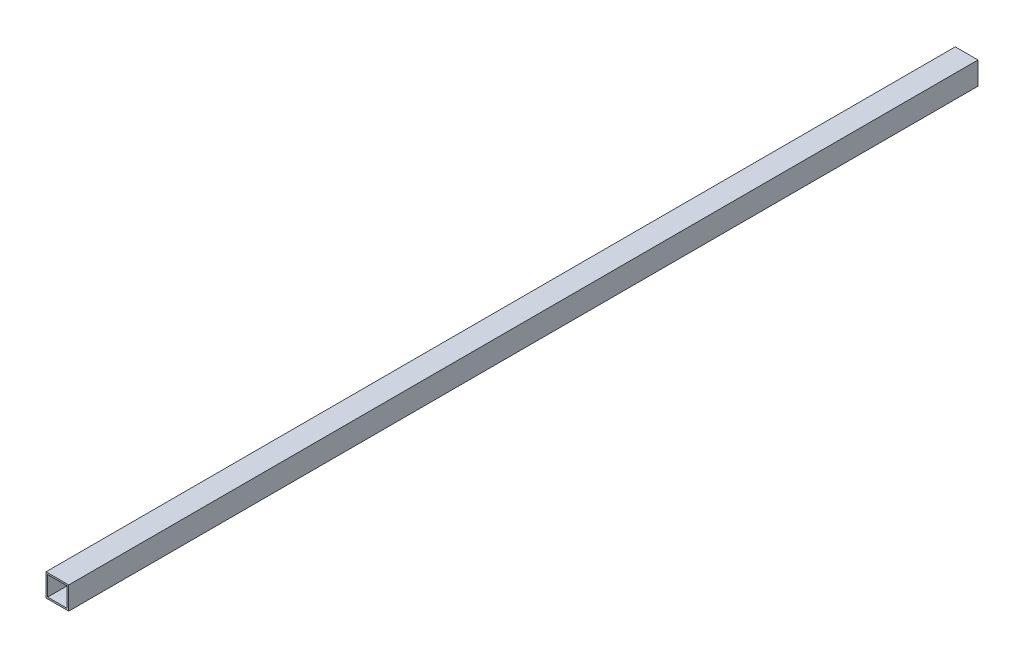
ISO-10303-21;
HEADER;
FILE_DESCRIPTION(('STEP AP214'),'2;1');
FILE_NAME('part.step','',(''),(''),'','','');
FILE_SCHEMA(('AUTOMOTIVE_DESIGN { 1 0 10303 214 1 1 1 1 }'));
ENDSEC;
DATA;
#1=APPLICATION_CONTEXT('core data for automotive mechanical design processes');
#2=APPLICATION_PROTOCOL_DEFINITION('international standard','automotive_design',2000,#1);
#3=PRODUCT_CONTEXT('',#1,'mechanical');
#4=PRODUCT('Part','Part','',(#3));
#5=PRODUCT_RELATED_PRODUCT_CATEGORY('part','',(#4));
#6=PRODUCT_DEFINITION_FORMATION('','',#4);
#7=PRODUCT_DEFINITION_CONTEXT('part definition',#1,'design');
#8=PRODUCT_DEFINITION('design','',#6,#7);
#9=PRODUCT_DEFINITION_SHAPE('','',#8);
#10=(LENGTH_UNIT() NAMED_UNIT(*) SI_UNIT(.MILLI.,.METRE.));
#11=(NAMED_UNIT(*) PLANE_ANGLE_UNIT() SI_UNIT($,.RADIAN.));
#12=(NAMED_UNIT(*) SI_UNIT($,.STERADIAN.) SOLID_ANGLE_UNIT());
#13=UNCERTAINTY_MEASURE_WITH_UNIT(LENGTH_MEASURE(1.E-05),#10,'distance_accuracy_value','');
#14=(GEOMETRIC_REPRESENTATION_CONTEXT(3) GLOBAL_UNCERTAINTY_ASSIGNED_CONTEXT((#13)) GLOBAL_UNIT_ASSIGNED_CONTEXT((#10,
#11,#12)) REPRESENTATION_CONTEXT('',''));
#15=CARTESIAN_POINT('',(0.,0.,0.));
#16=DIRECTION('',(0.,0.,1.));
#17=DIRECTION('',(1.,0.,0.));
#18=AXIS2_PLACEMENT_3D('',#15,#16,#17);
#19=CARTESIAN_POINT('',(-21.5935896339443,-24.317947895419,0.));
#20=DIRECTION('',(-1.,0.,0.));
#21=DIRECTION('',(0.,0.,1.));
#22=AXIS2_PLACEMENT_3D('',#19,#20,#21);
#23=PLANE('',#22);
#24=DIRECTION('',(0.,1.,0.));
#25=VECTOR('',#24,1.);
#26=CARTESIAN_POINT('',(-21.5935896339443,-5.26794789541903,0.));
#27=LINE('',#26,#25);
#28=CARTESIAN_POINT('',(-21.5935896339443,-24.317947895419,0.));
#29=VERTEX_POINT('',#28);
#30=CARTESIAN_POINT('',(-21.5935896339443,13.782052104581,0.));
#31=VERTEX_POINT('',#30);
#32=EDGE_CURVE('E105',#29,#31,#27,.T.);
#33=ORIENTED_EDGE('',*,*,#32,.T.);
#34=DIRECTION('',(0.,0.,1.));
#35=VECTOR('',#34,1.);
#36=CARTESIAN_POINT('',(-21.5935896339443,13.782052104581,0.));
#37=LINE('',#36,#35);
#38=CARTESIAN_POINT('',(-21.5935896339443,13.782052104581,1778.));
#39=VERTEX_POINT('',#38);
#40=EDGE_CURVE('E20',#31,#39,#37,.T.);
#41=ORIENTED_EDGE('',*,*,#40,.T.);
#42=DIRECTION('',(0.,1.,0.));
#43=VECTOR('',#42,1.);
#44=CARTESIAN_POINT('',(-21.5935896339443,-5.26794789541903,1778.));
#45=LINE('',#44,#43);
#46=CARTESIAN_POINT('',(-21.5935896339443,-24.317947895419,1778.));
#47=VERTEX_POINT('',#46);
#48=EDGE_CURVE('E117',#47,#39,#45,.T.);
#49=ORIENTED_EDGE('',*,*,#48,.F.);
#50=DIRECTION('',(0.,0.,-1.));
#51=VECTOR('',#50,1.);
#52=CARTESIAN_POINT('',(-21.5935896339443,-24.317947895419,0.));
#53=LINE('',#52,#51);
#54=EDGE_CURVE('E101',#47,#29,#53,.T.);
#55=ORIENTED_EDGE('',*,*,#54,.T.);
#56=EDGE_LOOP('',(#33,#41,#49,#55));
#57=FACE_BOUND('',#56,.T.);
#58=ADVANCED_FACE('F17',(#57),#23,.F.);
#59=CARTESIAN_POINT('',(-21.5935896339443,13.782052104581,0.));
#60=DIRECTION('',(0.,1.,0.));
#61=DIRECTION('',(0.,0.,1.));
#62=AXIS2_PLACEMENT_3D('',#59,#60,#61);
#63=PLANE('',#62);
#64=DIRECTION('',(1.,0.,0.));
#65=VECTOR('',#64,1.);
#66=CARTESIAN_POINT('',(-2.54358963394426,13.782052104581,0.));
#67=LINE('',#66,#65);
#68=CARTESIAN_POINT('',(16.5064103660557,13.782052104581,0.));
#69=VERTEX_POINT('',#68);
#70=EDGE_CURVE('E107',#31,#69,#67,.T.);
#71=ORIENTED_EDGE('',*,*,#70,.T.);
#72=DIRECTION('',(0.,0.,-1.));
#73=VECTOR('',#72,1.);
#74=CARTESIAN_POINT('',(16.5064103660557,13.782052104581,0.));
#75=LINE('',#74,#73);
#76=CARTESIAN_POINT('',(16.5064103660557,13.782052104581,1778.));
#77=VERTEX_POINT('',#76);
#78=EDGE_CURVE('E79',#69,#77,#75,.F.);
#79=ORIENTED_EDGE('',*,*,#78,.T.);
#80=DIRECTION('',(1.,0.,0.));
#81=VECTOR('',#80,1.);
#82=CARTESIAN_POINT('',(-2.54358963394426,13.782052104581,1778.));
#83=LINE('',#82,#81);
#84=EDGE_CURVE('E119',#39,#77,#83,.T.);
#85=ORIENTED_EDGE('',*,*,#84,.F.);
#86=ORIENTED_EDGE('',*,*,#40,.F.);
#87=EDGE_LOOP('',(#71,#79,#85,#86));
#88=FACE_BOUND('',#87,.T.);
#89=ADVANCED_FACE('F120',(#88),#63,.F.);
#90=CARTESIAN_POINT('',(16.5064103660557,13.782052104581,0.));
#91=DIRECTION('',(1.,0.,0.));
#92=DIRECTION('',(0.,0.,-1.));
#93=AXIS2_PLACEMENT_3D('',#90,#91,#92);
#94=PLANE('',#93);
#95=DIRECTION('',(0.,1.,0.));
#96=VECTOR('',#95,1.);
#97=CARTESIAN_POINT('',(16.5064103660557,-5.26794789541903,0.));
#98=LINE('',#97,#96);
#99=CARTESIAN_POINT('',(16.5064103660557,-24.317947895419,0.));
#100=VERTEX_POINT('',#99);
#101=EDGE_CURVE('E82',#69,#100,#98,.F.);
#102=ORIENTED_EDGE('',*,*,#101,.T.);
#103=DIRECTION('',(0.,0.,-1.));
#104=VECTOR('',#103,1.);
#105=CARTESIAN_POINT('',(16.5064103660557,-24.317947895419,0.));
#106=LINE('',#105,#104);
#107=CARTESIAN_POINT('',(16.5064103660557,-24.317947895419,1778.));
#108=VERTEX_POINT('',#107);
#109=EDGE_CURVE('E85',#100,#108,#106,.F.);
#110=ORIENTED_EDGE('',*,*,#109,.T.);
#111=DIRECTION('',(0.,1.,0.));
#112=VECTOR('',#111,1.);
#113=CARTESIAN_POINT('',(16.5064103660557,-5.26794789541903,1778.));
#114=LINE('',#113,#112);
#115=EDGE_CURVE('E122',#77,#108,#114,.F.);
#116=ORIENTED_EDGE('',*,*,#115,.F.);
#117=ORIENTED_EDGE('',*,*,#78,.F.);
#118=EDGE_LOOP('',(#102,#110,#116,#117));
#119=FACE_BOUND('',#118,.T.);
#120=ADVANCED_FACE('F84',(#119),#94,.F.);
#121=CARTESIAN_POINT('',(16.5064103660557,-24.317947895419,0.));
#122=DIRECTION('',(0.,-1.,0.));
#123=DIRECTION('',(0.,0.,-1.));
#124=AXIS2_PLACEMENT_3D('',#121,#122,#123);
#125=PLANE('',#124);
#126=DIRECTION('',(1.,0.,0.));
#127=VECTOR('',#126,1.);
#128=CARTESIAN_POINT('',(-2.54358963394426,-24.317947895419,0.));
#129=LINE('',#128,#127);
#130=EDGE_CURVE('E90',#100,#29,#129,.F.);
#131=ORIENTED_EDGE('',*,*,#130,.T.);
#132=ORIENTED_EDGE('',*,*,#54,.F.);
#133=DIRECTION('',(1.,0.,0.));
#134=VECTOR('',#133,1.);
#135=CARTESIAN_POINT('',(-2.54358963394426,-24.317947895419,1778.));
#136=LINE('',#135,#134);
#137=EDGE_CURVE('E99',#108,#47,#136,.F.);
#138=ORIENTED_EDGE('',*,*,#137,.F.);
#139=ORIENTED_EDGE('',*,*,#109,.F.);
#140=EDGE_LOOP('',(#131,#132,#138,#139));
#141=FACE_BOUND('',#140,.T.);
#142=ADVANCED_FACE('F95',(#141),#125,.F.);
#143=CARTESIAN_POINT('',(19.6814103660557,-27.4929478954189,0.));
#144=DIRECTION('',(0.,-1.,0.));
#145=DIRECTION('',(0.,0.,-1.));
#146=AXIS2_PLACEMENT_3D('',#143,#144,#145);
#147=PLANE('',#146);
#148=DIRECTION('',(1.,0.,0.));
#149=VECTOR('',#148,1.);
#150=CARTESIAN_POINT('',(-2.54358963394426,-27.4929478954189,1778.));
#151=LINE('',#150,#149);
#152=CARTESIAN_POINT('',(-24.7685896339443,-27.4929478954189,1778.));
#153=VERTEX_POINT('',#152);
#154=CARTESIAN_POINT('',(19.6814103660557,-27.4929478954189,1778.));
#155=VERTEX_POINT('',#154);
#156=EDGE_CURVE('E125',#153,#155,#151,.T.);
#157=ORIENTED_EDGE('',*,*,#156,.F.);
#158=DIRECTION('',(0.,0.,1.));
#159=VECTOR('',#158,1.);
#160=CARTESIAN_POINT('',(-24.7685896339443,-27.4929478954189,0.));
#161=LINE('',#160,#159);
#162=CARTESIAN_POINT('',(-24.7685896339443,-27.4929478954189,0.));
#163=VERTEX_POINT('',#162);
#164=EDGE_CURVE('E133',#163,#153,#161,.T.);
#165=ORIENTED_EDGE('',*,*,#164,.F.);
#166=DIRECTION('',(1.,0.,0.));
#167=VECTOR('',#166,1.);
#168=CARTESIAN_POINT('',(-2.54358963394426,-27.4929478954189,0.));
#169=LINE('',#168,#167);
#170=CARTESIAN_POINT('',(19.6814103660557,-27.4929478954189,0.));
#171=VERTEX_POINT('',#170);
#172=EDGE_CURVE('E91',#163,#171,#169,.T.);
#173=ORIENTED_EDGE('',*,*,#172,.T.);
#174=DIRECTION('',(0.,0.,-1.));
#175=VECTOR('',#174,1.);
#176=CARTESIAN_POINT('',(19.6814103660557,-27.4929478954189,0.));
#177=LINE('',#176,#175);
#178=EDGE_CURVE('E153',#155,#171,#177,.T.);
#179=ORIENTED_EDGE('',*,*,#178,.F.);
#180=EDGE_LOOP('',(#157,#165,#173,#179));
#181=FACE_BOUND('',#180,.T.);
#182=ADVANCED_FACE('F152',(#181),#147,.T.);
#183=CARTESIAN_POINT('',(-2.54358963394426,-5.26794789541903,0.));
#184=DIRECTION('',(0.,0.,1.));
#185=DIRECTION('',(1.,0.,0.));
#186=AXIS2_PLACEMENT_3D('',#183,#184,#185);
#187=PLANE('',#186);
#188=ORIENTED_EDGE('',*,*,#32,.F.);
#189=ORIENTED_EDGE('',*,*,#130,.F.);
#190=ORIENTED_EDGE('',*,*,#101,.F.);
#191=ORIENTED_EDGE('',*,*,#70,.F.);
#192=EDGE_LOOP('',(#188,#189,#190,#191));
#193=FACE_BOUND('',#192,.T.);
#194=ORIENTED_EDGE('',*,*,#172,.F.);
#195=DIRECTION('',(0.,1.,0.));
#196=VECTOR('',#195,1.);
#197=CARTESIAN_POINT('',(-24.7685896339443,-27.4929478954189,0.));
#198=LINE('',#197,#196);
#199=CARTESIAN_POINT('',(-24.7685896339443,16.957052104581,0.));
#200=VERTEX_POINT('',#199);
#201=EDGE_CURVE('E135',#200,#163,#198,.F.);
#202=ORIENTED_EDGE('',*,*,#201,.F.);
#203=DIRECTION('',(1.,0.,0.));
#204=VECTOR('',#203,1.);
#205=CARTESIAN_POINT('',(-24.7685896339443,16.957052104581,0.));
#206=LINE('',#205,#204);
#207=CARTESIAN_POINT('',(19.6814103660557,16.957052104581,0.));
#208=VERTEX_POINT('',#207);
#209=EDGE_CURVE('E146',#208,#200,#206,.F.);
#210=ORIENTED_EDGE('',*,*,#209,.F.);
#211=DIRECTION('',(0.,1.,0.));
#212=VECTOR('',#211,1.);
#213=CARTESIAN_POINT('',(19.6814103660557,16.957052104581,0.));
#214=LINE('',#213,#212);
#215=EDGE_CURVE('E148',#171,#208,#214,.T.);
#216=ORIENTED_EDGE('',*,*,#215,.F.);
#217=EDGE_LOOP('',(#194,#202,#210,#216));
#218=FACE_BOUND('',#217,.T.);
#219=ADVANCED_FACE('F103',(#193,#218),#187,.F.);
#220=CARTESIAN_POINT('',(-24.7685896339443,-27.4929478954189,0.));
#221=DIRECTION('',(-1.,0.,0.));
#222=DIRECTION('',(0.,0.,1.));
#223=AXIS2_PLACEMENT_3D('',#220,#221,#222);
#224=PLANE('',#223);
#225=DIRECTION('',(0.,1.,0.));
#226=VECTOR('',#225,1.);
#227=CARTESIAN_POINT('',(-24.7685896339443,-5.26794789541903,1778.));
#228=LINE('',#227,#226);
#229=CARTESIAN_POINT('',(-24.7685896339443,16.957052104581,1778.));
#230=VERTEX_POINT('',#229);
#231=EDGE_CURVE('E127',#230,#153,#228,.F.);
#232=ORIENTED_EDGE('',*,*,#231,.F.);
#233=DIRECTION('',(0.,0.,1.));
#234=VECTOR('',#233,1.);
#235=CARTESIAN_POINT('',(-24.7685896339443,16.957052104581,0.));
#236=LINE('',#235,#234);
#237=EDGE_CURVE('E143',#200,#230,#236,.T.);
#238=ORIENTED_EDGE('',*,*,#237,.F.);
#239=ORIENTED_EDGE('',*,*,#201,.T.);
#240=ORIENTED_EDGE('',*,*,#164,.T.);
#241=EDGE_LOOP('',(#232,#238,#239,#240));
#242=FACE_BOUND('',#241,.T.);
#243=ADVANCED_FACE('F139',(#242),#224,.T.);
#244=CARTESIAN_POINT('',(-2.54358963394426,-5.26794789541903,1778.));
#245=DIRECTION('',(0.,0.,1.));
#246=DIRECTION('',(1.,0.,0.));
#247=AXIS2_PLACEMENT_3D('',#244,#245,#246);
#248=PLANE('',#247);
#249=ORIENTED_EDGE('',*,*,#115,.T.);
#250=ORIENTED_EDGE('',*,*,#137,.T.);
#251=ORIENTED_EDGE('',*,*,#48,.T.);
#252=ORIENTED_EDGE('',*,*,#84,.T.);
#253=EDGE_LOOP('',(#249,#250,#251,#252));
#254=FACE_BOUND('',#253,.T.);
#255=DIRECTION('',(0.,1.,0.));
#256=VECTOR('',#255,1.);
#257=CARTESIAN_POINT('',(19.6814103660557,16.957052104581,1778.));
#258=LINE('',#257,#256);
#259=CARTESIAN_POINT('',(19.6814103660557,16.957052104581,1778.));
#260=VERTEX_POINT('',#259);
#261=EDGE_CURVE('E35',#260,#155,#258,.F.);
#262=ORIENTED_EDGE('',*,*,#261,.F.);
#263=DIRECTION('',(1.,0.,0.));
#264=VECTOR('',#263,1.);
#265=CARTESIAN_POINT('',(-24.7685896339443,16.957052104581,1778.));
#266=LINE('',#265,#264);
#267=EDGE_CURVE('E26',#230,#260,#266,.T.);
#268=ORIENTED_EDGE('',*,*,#267,.F.);
#269=ORIENTED_EDGE('',*,*,#231,.T.);
#270=ORIENTED_EDGE('',*,*,#156,.T.);
#271=EDGE_LOOP('',(#262,#268,#269,#270));
#272=FACE_BOUND('',#271,.T.);
#273=ADVANCED_FACE('F124',(#254,#272),#248,.T.);
#274=CARTESIAN_POINT('',(19.6814103660557,16.957052104581,0.));
#275=DIRECTION('',(1.,0.,0.));
#276=DIRECTION('',(0.,0.,-1.));
#277=AXIS2_PLACEMENT_3D('',#274,#275,#276);
#278=PLANE('',#277);
#279=ORIENTED_EDGE('',*,*,#261,.T.);
#280=ORIENTED_EDGE('',*,*,#178,.T.);
#281=ORIENTED_EDGE('',*,*,#215,.T.);
#282=DIRECTION('',(0.,0.,1.));
#283=VECTOR('',#282,1.);
#284=CARTESIAN_POINT('',(19.6814103660557,16.957052104581,0.));
#285=LINE('',#284,#283);
#286=EDGE_CURVE('E11',#260,#208,#285,.F.);
#287=ORIENTED_EDGE('',*,*,#286,.F.);
#288=EDGE_LOOP('',(#279,#280,#281,#287));
#289=FACE_BOUND('',#288,.T.);
#290=ADVANCED_FACE('F165',(#289),#278,.T.);
#291=CARTESIAN_POINT('',(-24.7685896339443,16.957052104581,0.));
#292=DIRECTION('',(0.,1.,0.));
#293=DIRECTION('',(0.,0.,1.));
#294=AXIS2_PLACEMENT_3D('',#291,#292,#293);
#295=PLANE('',#294);
#296=ORIENTED_EDGE('',*,*,#267,.T.);
#297=ORIENTED_EDGE('',*,*,#286,.T.);
#298=ORIENTED_EDGE('',*,*,#209,.T.);
#299=ORIENTED_EDGE('',*,*,#237,.T.);
#300=EDGE_LOOP('',(#296,#297,#298,#299));
#301=FACE_BOUND('',#300,.T.);
#302=ADVANCED_FACE('F157',(#301),#295,.T.);
#303=CLOSED_SHELL('',(#58,#89,#120,#142,#182,#219,#243,#273,#290,#302));
#304=MANIFOLD_SOLID_BREP('B1',#303);
#305=ADVANCED_BREP_SHAPE_REPRESENTATION('',(#18,#304),#14);
#306=SHAPE_DEFINITION_REPRESENTATION(#9,#305);
ENDSEC;
END-ISO-10303-21;
